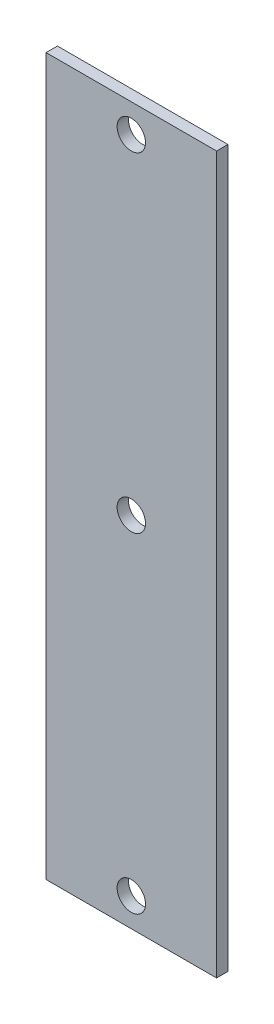
ISO-10303-21;
HEADER;
FILE_DESCRIPTION(('STEP AP214'),'2;1');
FILE_NAME('part.step','',(''),(''),'','','');
FILE_SCHEMA(('AUTOMOTIVE_DESIGN { 1 0 10303 214 1 1 1 1 }'));
ENDSEC;
DATA;
#1=APPLICATION_CONTEXT('core data for automotive mechanical design processes');
#2=APPLICATION_PROTOCOL_DEFINITION('international standard','automotive_design',2000,#1);
#3=PRODUCT_CONTEXT('',#1,'mechanical');
#4=PRODUCT('Part','Part','',(#3));
#5=PRODUCT_RELATED_PRODUCT_CATEGORY('part','',(#4));
#6=PRODUCT_DEFINITION_FORMATION('','',#4);
#7=PRODUCT_DEFINITION_CONTEXT('part definition',#1,'design');
#8=PRODUCT_DEFINITION('design','',#6,#7);
#9=PRODUCT_DEFINITION_SHAPE('','',#8);
#10=(LENGTH_UNIT() NAMED_UNIT(*) SI_UNIT(.MILLI.,.METRE.));
#11=(NAMED_UNIT(*) PLANE_ANGLE_UNIT() SI_UNIT($,.RADIAN.));
#12=(NAMED_UNIT(*) SI_UNIT($,.STERADIAN.) SOLID_ANGLE_UNIT());
#13=UNCERTAINTY_MEASURE_WITH_UNIT(LENGTH_MEASURE(1.E-05),#10,'distance_accuracy_value','');
#14=(GEOMETRIC_REPRESENTATION_CONTEXT(3) GLOBAL_UNCERTAINTY_ASSIGNED_CONTEXT((#13)) GLOBAL_UNIT_ASSIGNED_CONTEXT((#10,
#11,#12)) REPRESENTATION_CONTEXT('',''));
#15=CARTESIAN_POINT('',(0.,0.,0.));
#16=DIRECTION('',(0.,0.,1.));
#17=DIRECTION('',(1.,0.,0.));
#18=AXIS2_PLACEMENT_3D('',#15,#16,#17);
#19=CARTESIAN_POINT('',(0.,0.,2.));
#20=DIRECTION('',(0.,0.,1.));
#21=DIRECTION('',(1.,0.,0.));
#22=AXIS2_PLACEMENT_3D('',#19,#20,#21);
#23=PLANE('',#22);
#24=CARTESIAN_POINT('',(0.,-58.,2.));
#25=DIRECTION('',(0.,0.,1.));
#26=DIRECTION('',(1.,0.,0.));
#27=AXIS2_PLACEMENT_3D('',#24,#25,#26);
#28=CIRCLE('',#27,2.5);
#29=CARTESIAN_POINT('',(2.5,-58.,2.));
#30=VERTEX_POINT('',#29);
#31=EDGE_CURVE('E119',#30,#30,#28,.T.);
#32=ORIENTED_EDGE('',*,*,#31,.F.);
#33=EDGE_LOOP('',(#32));
#34=FACE_BOUND('',#33,.T.);
#35=DIRECTION('',(0.,1.,0.));
#36=VECTOR('',#35,1.);
#37=CARTESIAN_POINT('',(15.,63.,2.));
#38=LINE('',#37,#36);
#39=CARTESIAN_POINT('',(15.,-63.,2.));
#40=VERTEX_POINT('',#39);
#41=CARTESIAN_POINT('',(15.,63.,2.));
#42=VERTEX_POINT('',#41);
#43=EDGE_CURVE('E89',#40,#42,#38,.T.);
#44=ORIENTED_EDGE('',*,*,#43,.T.);
#45=DIRECTION('',(-1.,0.,0.));
#46=VECTOR('',#45,1.);
#47=CARTESIAN_POINT('',(-15.,63.,2.));
#48=LINE('',#47,#46);
#49=CARTESIAN_POINT('',(-15.,63.,2.));
#50=VERTEX_POINT('',#49);
#51=EDGE_CURVE('E84',#42,#50,#48,.T.);
#52=ORIENTED_EDGE('',*,*,#51,.T.);
#53=DIRECTION('',(0.,-1.,0.));
#54=VECTOR('',#53,1.);
#55=CARTESIAN_POINT('',(-15.,63.,2.));
#56=LINE('',#55,#54);
#57=CARTESIAN_POINT('',(-15.,-63.,2.));
#58=VERTEX_POINT('',#57);
#59=EDGE_CURVE('E87',#50,#58,#56,.T.);
#60=ORIENTED_EDGE('',*,*,#59,.T.);
#61=DIRECTION('',(1.,0.,0.));
#62=VECTOR('',#61,1.);
#63=CARTESIAN_POINT('',(-15.,-63.,2.));
#64=LINE('',#63,#62);
#65=EDGE_CURVE('E54',#58,#40,#64,.T.);
#66=ORIENTED_EDGE('',*,*,#65,.T.);
#67=EDGE_LOOP('',(#44,#52,#60,#66));
#68=FACE_BOUND('',#67,.T.);
#69=CARTESIAN_POINT('',(0.,58.,2.));
#70=DIRECTION('',(0.,0.,1.));
#71=DIRECTION('',(1.,0.,0.));
#72=AXIS2_PLACEMENT_3D('',#69,#70,#71);
#73=CIRCLE('',#72,2.5);
#74=CARTESIAN_POINT('',(2.5,58.,2.));
#75=VERTEX_POINT('',#74);
#76=EDGE_CURVE('E104',#75,#75,#73,.T.);
#77=ORIENTED_EDGE('',*,*,#76,.F.);
#78=EDGE_LOOP('',(#77));
#79=FACE_BOUND('',#78,.T.);
#80=CARTESIAN_POINT('',(0.,0.,2.));
#81=DIRECTION('',(0.,0.,1.));
#82=DIRECTION('',(1.,0.,0.));
#83=AXIS2_PLACEMENT_3D('',#80,#81,#82);
#84=CIRCLE('',#83,2.5);
#85=CARTESIAN_POINT('',(2.5,0.,2.));
#86=VERTEX_POINT('',#85);
#87=EDGE_CURVE('E125',#86,#86,#84,.T.);
#88=ORIENTED_EDGE('',*,*,#87,.F.);
#89=EDGE_LOOP('',(#88));
#90=FACE_BOUND('',#89,.T.);
#91=ADVANCED_FACE('F37',(#34,#68,#79,#90),#23,.T.);
#92=CARTESIAN_POINT('',(0.,0.,0.));
#93=DIRECTION('',(0.,0.,1.));
#94=DIRECTION('',(1.,0.,0.));
#95=AXIS2_PLACEMENT_3D('',#92,#93,#94);
#96=PLANE('',#95);
#97=DIRECTION('',(0.,1.,0.));
#98=VECTOR('',#97,1.);
#99=CARTESIAN_POINT('',(15.,63.,0.));
#100=LINE('',#99,#98);
#101=CARTESIAN_POINT('',(15.,-63.,0.));
#102=VERTEX_POINT('',#101);
#103=CARTESIAN_POINT('',(15.,63.,0.));
#104=VERTEX_POINT('',#103);
#105=EDGE_CURVE('E101',#102,#104,#100,.T.);
#106=ORIENTED_EDGE('',*,*,#105,.F.);
#107=DIRECTION('',(1.,0.,0.));
#108=VECTOR('',#107,1.);
#109=CARTESIAN_POINT('',(-15.,-63.,0.));
#110=LINE('',#109,#108);
#111=CARTESIAN_POINT('',(-15.,-63.,0.));
#112=VERTEX_POINT('',#111);
#113=EDGE_CURVE('E77',#112,#102,#110,.T.);
#114=ORIENTED_EDGE('',*,*,#113,.F.);
#115=DIRECTION('',(0.,-1.,0.));
#116=VECTOR('',#115,1.);
#117=CARTESIAN_POINT('',(-15.,63.,0.));
#118=LINE('',#117,#116);
#119=CARTESIAN_POINT('',(-15.,63.,0.));
#120=VERTEX_POINT('',#119);
#121=EDGE_CURVE('E71',#120,#112,#118,.T.);
#122=ORIENTED_EDGE('',*,*,#121,.F.);
#123=DIRECTION('',(-1.,0.,0.));
#124=VECTOR('',#123,1.);
#125=CARTESIAN_POINT('',(-15.,63.,0.));
#126=LINE('',#125,#124);
#127=EDGE_CURVE('E93',#104,#120,#126,.T.);
#128=ORIENTED_EDGE('',*,*,#127,.F.);
#129=EDGE_LOOP('',(#106,#114,#122,#128));
#130=FACE_BOUND('',#129,.T.);
#131=CARTESIAN_POINT('',(0.,58.,0.));
#132=DIRECTION('',(0.,0.,1.));
#133=DIRECTION('',(1.,0.,0.));
#134=AXIS2_PLACEMENT_3D('',#131,#132,#133);
#135=CIRCLE('',#134,2.5);
#136=CARTESIAN_POINT('',(2.5,58.,0.));
#137=VERTEX_POINT('',#136);
#138=EDGE_CURVE('E116',#137,#137,#135,.T.);
#139=ORIENTED_EDGE('',*,*,#138,.T.);
#140=EDGE_LOOP('',(#139));
#141=FACE_BOUND('',#140,.T.);
#142=CARTESIAN_POINT('',(0.,-58.,0.));
#143=DIRECTION('',(0.,0.,1.));
#144=DIRECTION('',(1.,0.,0.));
#145=AXIS2_PLACEMENT_3D('',#142,#143,#144);
#146=CIRCLE('',#145,2.5);
#147=CARTESIAN_POINT('',(2.5,-58.,0.));
#148=VERTEX_POINT('',#147);
#149=EDGE_CURVE('E122',#148,#148,#146,.T.);
#150=ORIENTED_EDGE('',*,*,#149,.T.);
#151=EDGE_LOOP('',(#150));
#152=FACE_BOUND('',#151,.T.);
#153=CARTESIAN_POINT('',(0.,0.,0.));
#154=DIRECTION('',(0.,0.,1.));
#155=DIRECTION('',(1.,0.,0.));
#156=AXIS2_PLACEMENT_3D('',#153,#154,#155);
#157=CIRCLE('',#156,2.5);
#158=CARTESIAN_POINT('',(2.5,0.,0.));
#159=VERTEX_POINT('',#158);
#160=EDGE_CURVE('E128',#159,#159,#157,.T.);
#161=ORIENTED_EDGE('',*,*,#160,.T.);
#162=EDGE_LOOP('',(#161));
#163=FACE_BOUND('',#162,.T.);
#164=ADVANCED_FACE('F112',(#130,#141,#152,#163),#96,.F.);
#165=CARTESIAN_POINT('',(15.,63.,2.));
#166=DIRECTION('',(-1.,0.,0.));
#167=DIRECTION('',(0.,-1.,0.));
#168=AXIS2_PLACEMENT_3D('',#165,#166,#167);
#169=PLANE('',#168);
#170=ORIENTED_EDGE('',*,*,#105,.T.);
#171=DIRECTION('',(0.,0.,-1.));
#172=VECTOR('',#171,1.);
#173=CARTESIAN_POINT('',(15.,63.,2.));
#174=LINE('',#173,#172);
#175=EDGE_CURVE('E11',#42,#104,#174,.T.);
#176=ORIENTED_EDGE('',*,*,#175,.F.);
#177=ORIENTED_EDGE('',*,*,#43,.F.);
#178=DIRECTION('',(0.,0.,-1.));
#179=VECTOR('',#178,1.);
#180=CARTESIAN_POINT('',(15.,-63.,2.));
#181=LINE('',#180,#179);
#182=EDGE_CURVE('E97',#40,#102,#181,.T.);
#183=ORIENTED_EDGE('',*,*,#182,.T.);
#184=EDGE_LOOP('',(#170,#176,#177,#183));
#185=FACE_BOUND('',#184,.T.);
#186=ADVANCED_FACE('F39',(#185),#169,.F.);
#187=CARTESIAN_POINT('',(-15.,63.,2.));
#188=DIRECTION('',(0.,-1.,0.));
#189=DIRECTION('',(0.,0.,-1.));
#190=AXIS2_PLACEMENT_3D('',#187,#188,#189);
#191=PLANE('',#190);
#192=ORIENTED_EDGE('',*,*,#127,.T.);
#193=DIRECTION('',(0.,0.,-1.));
#194=VECTOR('',#193,1.);
#195=CARTESIAN_POINT('',(-15.,63.,2.));
#196=LINE('',#195,#194);
#197=EDGE_CURVE('E46',#50,#120,#196,.T.);
#198=ORIENTED_EDGE('',*,*,#197,.F.);
#199=ORIENTED_EDGE('',*,*,#51,.F.);
#200=ORIENTED_EDGE('',*,*,#175,.T.);
#201=EDGE_LOOP('',(#192,#198,#199,#200));
#202=FACE_BOUND('',#201,.T.);
#203=ADVANCED_FACE('F92',(#202),#191,.F.);
#204=CARTESIAN_POINT('',(-15.,63.,2.));
#205=DIRECTION('',(1.,0.,0.));
#206=DIRECTION('',(0.,1.,0.));
#207=AXIS2_PLACEMENT_3D('',#204,#205,#206);
#208=PLANE('',#207);
#209=ORIENTED_EDGE('',*,*,#121,.T.);
#210=DIRECTION('',(0.,0.,-1.));
#211=VECTOR('',#210,1.);
#212=CARTESIAN_POINT('',(-15.,-63.,2.));
#213=LINE('',#212,#211);
#214=EDGE_CURVE('E94',#58,#112,#213,.T.);
#215=ORIENTED_EDGE('',*,*,#214,.F.);
#216=ORIENTED_EDGE('',*,*,#59,.F.);
#217=ORIENTED_EDGE('',*,*,#197,.T.);
#218=EDGE_LOOP('',(#209,#215,#216,#217));
#219=FACE_BOUND('',#218,.T.);
#220=ADVANCED_FACE('F95',(#219),#208,.F.);
#221=CARTESIAN_POINT('',(-15.,-63.,2.));
#222=DIRECTION('',(0.,1.,0.));
#223=DIRECTION('',(0.,0.,1.));
#224=AXIS2_PLACEMENT_3D('',#221,#222,#223);
#225=PLANE('',#224);
#226=ORIENTED_EDGE('',*,*,#113,.T.);
#227=ORIENTED_EDGE('',*,*,#182,.F.);
#228=ORIENTED_EDGE('',*,*,#65,.F.);
#229=ORIENTED_EDGE('',*,*,#214,.T.);
#230=EDGE_LOOP('',(#226,#227,#228,#229));
#231=FACE_BOUND('',#230,.T.);
#232=ADVANCED_FACE('F109',(#231),#225,.F.);
#233=CARTESIAN_POINT('',(0.,58.,2.));
#234=DIRECTION('',(0.,0.,-1.));
#235=DIRECTION('',(-1.,0.,0.));
#236=AXIS2_PLACEMENT_3D('',#233,#234,#235);
#237=CYLINDRICAL_SURFACE('',#236,2.5);
#238=ORIENTED_EDGE('',*,*,#76,.T.);
#239=EDGE_LOOP('',(#238));
#240=FACE_BOUND('',#239,.T.);
#241=ORIENTED_EDGE('',*,*,#138,.F.);
#242=EDGE_LOOP('',(#241));
#243=FACE_BOUND('',#242,.T.);
#244=ADVANCED_FACE('F146',(#240,#243),#237,.F.);
#245=CARTESIAN_POINT('',(0.,-58.,2.));
#246=DIRECTION('',(0.,0.,-1.));
#247=DIRECTION('',(-1.,0.,0.));
#248=AXIS2_PLACEMENT_3D('',#245,#246,#247);
#249=CYLINDRICAL_SURFACE('',#248,2.5);
#250=ORIENTED_EDGE('',*,*,#31,.T.);
#251=EDGE_LOOP('',(#250));
#252=FACE_BOUND('',#251,.T.);
#253=ORIENTED_EDGE('',*,*,#149,.F.);
#254=EDGE_LOOP('',(#253));
#255=FACE_BOUND('',#254,.T.);
#256=ADVANCED_FACE('F192',(#252,#255),#249,.F.);
#257=CARTESIAN_POINT('',(0.,0.,2.));
#258=DIRECTION('',(0.,0.,-1.));
#259=DIRECTION('',(-1.,0.,0.));
#260=AXIS2_PLACEMENT_3D('',#257,#258,#259);
#261=CYLINDRICAL_SURFACE('',#260,2.5);
#262=ORIENTED_EDGE('',*,*,#87,.T.);
#263=EDGE_LOOP('',(#262));
#264=FACE_BOUND('',#263,.T.);
#265=ORIENTED_EDGE('',*,*,#160,.F.);
#266=EDGE_LOOP('',(#265));
#267=FACE_BOUND('',#266,.T.);
#268=ADVANCED_FACE('F134',(#264,#267),#261,.F.);
#269=CLOSED_SHELL('',(#91,#164,#186,#203,#220,#232,#244,#256,#268));
#270=MANIFOLD_SOLID_BREP('B2',#269);
#271=ADVANCED_BREP_SHAPE_REPRESENTATION('',(#18,#270),#14);
#272=SHAPE_DEFINITION_REPRESENTATION(#9,#271);
ENDSEC;
END-ISO-10303-21;
